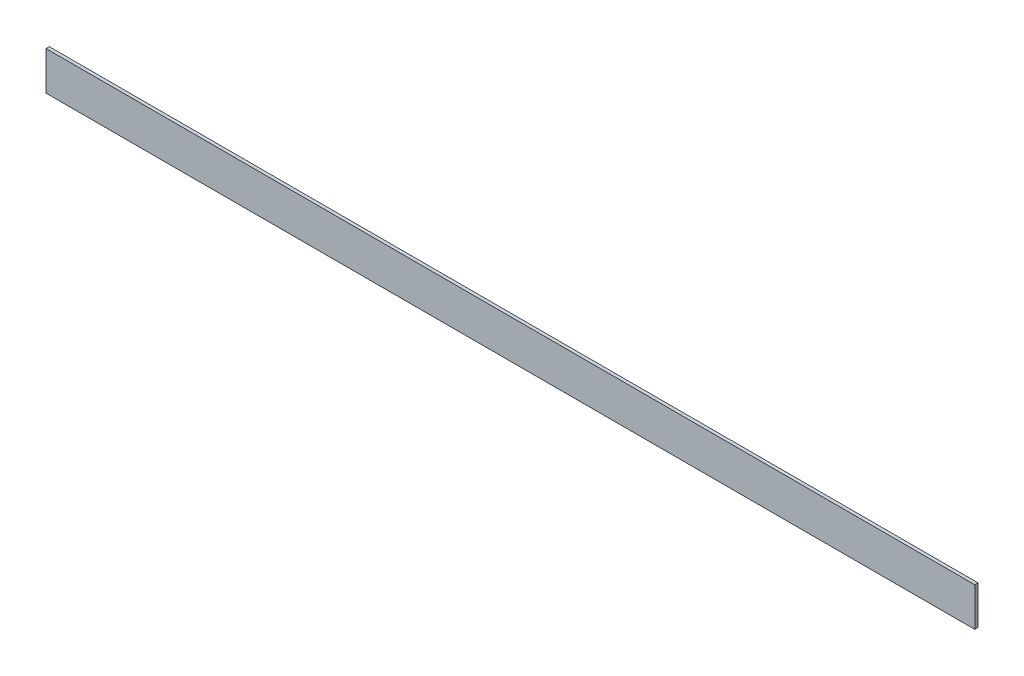
ISO-10303-21;
HEADER;
FILE_DESCRIPTION(('STEP AP214'),'2;1');
FILE_NAME('part.step','',(''),(''),'','','');
FILE_SCHEMA(('AUTOMOTIVE_DESIGN { 1 0 10303 214 1 1 1 1 }'));
ENDSEC;
DATA;
#1=APPLICATION_CONTEXT('core data for automotive mechanical design processes');
#2=APPLICATION_PROTOCOL_DEFINITION('international standard','automotive_design',2000,#1);
#3=PRODUCT_CONTEXT('',#1,'mechanical');
#4=PRODUCT('Part','Part','',(#3));
#5=PRODUCT_RELATED_PRODUCT_CATEGORY('part','',(#4));
#6=PRODUCT_DEFINITION_FORMATION('','',#4);
#7=PRODUCT_DEFINITION_CONTEXT('part definition',#1,'design');
#8=PRODUCT_DEFINITION('design','',#6,#7);
#9=PRODUCT_DEFINITION_SHAPE('','',#8);
#10=(LENGTH_UNIT() NAMED_UNIT(*) SI_UNIT(.MILLI.,.METRE.));
#11=(NAMED_UNIT(*) PLANE_ANGLE_UNIT() SI_UNIT($,.RADIAN.));
#12=(NAMED_UNIT(*) SI_UNIT($,.STERADIAN.) SOLID_ANGLE_UNIT());
#13=UNCERTAINTY_MEASURE_WITH_UNIT(LENGTH_MEASURE(1.E-05),#10,'distance_accuracy_value','');
#14=(GEOMETRIC_REPRESENTATION_CONTEXT(3) GLOBAL_UNCERTAINTY_ASSIGNED_CONTEXT((#13)) GLOBAL_UNIT_ASSIGNED_CONTEXT((#10,
#11,#12)) REPRESENTATION_CONTEXT('',''));
#15=CARTESIAN_POINT('',(0.,0.,0.));
#16=DIRECTION('',(0.,0.,1.));
#17=DIRECTION('',(1.,0.,0.));
#18=AXIS2_PLACEMENT_3D('',#15,#16,#17);
#19=CARTESIAN_POINT('',(1828.8,-38.1,-3.175));
#20=DIRECTION('',(0.,0.,1.));
#21=DIRECTION('',(1.,0.,0.));
#22=AXIS2_PLACEMENT_3D('',#19,#20,#21);
#23=PLANE('',#22);
#24=DIRECTION('',(0.,1.,0.));
#25=VECTOR('',#24,1.);
#26=CARTESIAN_POINT('',(0.,-38.1,-3.175));
#27=LINE('',#26,#25);
#28=CARTESIAN_POINT('',(0.,-38.1,-3.175));
#29=VERTEX_POINT('',#28);
#30=CARTESIAN_POINT('',(0.,38.1,-3.175));
#31=VERTEX_POINT('',#30);
#32=EDGE_CURVE('E98',#29,#31,#27,.T.);
#33=ORIENTED_EDGE('',*,*,#32,.T.);
#34=DIRECTION('',(-1.,0.,0.));
#35=VECTOR('',#34,1.);
#36=CARTESIAN_POINT('',(1828.8,38.1,-3.175));
#37=LINE('',#36,#35);
#38=CARTESIAN_POINT('',(1828.8,38.1,-3.175));
#39=VERTEX_POINT('',#38);
#40=EDGE_CURVE('E11',#39,#31,#37,.T.);
#41=ORIENTED_EDGE('',*,*,#40,.F.);
#42=DIRECTION('',(0.,1.,0.));
#43=VECTOR('',#42,1.);
#44=CARTESIAN_POINT('',(1828.8,-38.1,-3.175));
#45=LINE('',#44,#43);
#46=CARTESIAN_POINT('',(1828.8,-38.1,-3.175));
#47=VERTEX_POINT('',#46);
#48=EDGE_CURVE('E86',#47,#39,#45,.T.);
#49=ORIENTED_EDGE('',*,*,#48,.F.);
#50=DIRECTION('',(-1.,0.,0.));
#51=VECTOR('',#50,1.);
#52=CARTESIAN_POINT('',(1828.8,-38.1,-3.175));
#53=LINE('',#52,#51);
#54=EDGE_CURVE('E94',#47,#29,#53,.T.);
#55=ORIENTED_EDGE('',*,*,#54,.T.);
#56=EDGE_LOOP('',(#33,#41,#49,#55));
#57=FACE_BOUND('',#56,.T.);
#58=ADVANCED_FACE('F35',(#57),#23,.F.);
#59=CARTESIAN_POINT('',(1828.8,38.1,3.175));
#60=DIRECTION('',(0.,-1.,0.));
#61=DIRECTION('',(0.,0.,-1.));
#62=AXIS2_PLACEMENT_3D('',#59,#60,#61);
#63=PLANE('',#62);
#64=DIRECTION('',(0.,0.,1.));
#65=VECTOR('',#64,1.);
#66=CARTESIAN_POINT('',(0.,38.1,3.175));
#67=LINE('',#66,#65);
#68=CARTESIAN_POINT('',(0.,38.1,3.175));
#69=VERTEX_POINT('',#68);
#70=EDGE_CURVE('E90',#31,#69,#67,.T.);
#71=ORIENTED_EDGE('',*,*,#70,.T.);
#72=DIRECTION('',(-1.,0.,0.));
#73=VECTOR('',#72,1.);
#74=CARTESIAN_POINT('',(1828.8,38.1,3.175));
#75=LINE('',#74,#73);
#76=CARTESIAN_POINT('',(1828.8,38.1,3.175));
#77=VERTEX_POINT('',#76);
#78=EDGE_CURVE('E43',#77,#69,#75,.T.);
#79=ORIENTED_EDGE('',*,*,#78,.F.);
#80=DIRECTION('',(0.,0.,1.));
#81=VECTOR('',#80,1.);
#82=CARTESIAN_POINT('',(1828.8,38.1,3.175));
#83=LINE('',#82,#81);
#84=EDGE_CURVE('E81',#39,#77,#83,.T.);
#85=ORIENTED_EDGE('',*,*,#84,.F.);
#86=ORIENTED_EDGE('',*,*,#40,.T.);
#87=EDGE_LOOP('',(#71,#79,#85,#86));
#88=FACE_BOUND('',#87,.T.);
#89=ADVANCED_FACE('F89',(#88),#63,.F.);
#90=CARTESIAN_POINT('',(1828.8,-38.1,3.175));
#91=DIRECTION('',(0.,0.,-1.));
#92=DIRECTION('',(-1.,0.,0.));
#93=AXIS2_PLACEMENT_3D('',#90,#91,#92);
#94=PLANE('',#93);
#95=DIRECTION('',(0.,-1.,0.));
#96=VECTOR('',#95,1.);
#97=CARTESIAN_POINT('',(0.,-38.1,3.175));
#98=LINE('',#97,#96);
#99=CARTESIAN_POINT('',(0.,-38.1,3.175));
#100=VERTEX_POINT('',#99);
#101=EDGE_CURVE('E68',#69,#100,#98,.T.);
#102=ORIENTED_EDGE('',*,*,#101,.T.);
#103=DIRECTION('',(-1.,0.,0.));
#104=VECTOR('',#103,1.);
#105=CARTESIAN_POINT('',(1828.8,-38.1,3.175));
#106=LINE('',#105,#104);
#107=CARTESIAN_POINT('',(1828.8,-38.1,3.175));
#108=VERTEX_POINT('',#107);
#109=EDGE_CURVE('E91',#108,#100,#106,.T.);
#110=ORIENTED_EDGE('',*,*,#109,.F.);
#111=DIRECTION('',(0.,-1.,0.));
#112=VECTOR('',#111,1.);
#113=CARTESIAN_POINT('',(1828.8,-38.1,3.175));
#114=LINE('',#113,#112);
#115=EDGE_CURVE('E84',#77,#108,#114,.T.);
#116=ORIENTED_EDGE('',*,*,#115,.F.);
#117=ORIENTED_EDGE('',*,*,#78,.T.);
#118=EDGE_LOOP('',(#102,#110,#116,#117));
#119=FACE_BOUND('',#118,.T.);
#120=ADVANCED_FACE('F92',(#119),#94,.F.);
#121=CARTESIAN_POINT('',(1828.8,-38.1,3.175));
#122=DIRECTION('',(0.,1.,0.));
#123=DIRECTION('',(0.,0.,1.));
#124=AXIS2_PLACEMENT_3D('',#121,#122,#123);
#125=PLANE('',#124);
#126=DIRECTION('',(0.,0.,-1.));
#127=VECTOR('',#126,1.);
#128=CARTESIAN_POINT('',(0.,-38.1,3.175));
#129=LINE('',#128,#127);
#130=EDGE_CURVE('E74',#100,#29,#129,.T.);
#131=ORIENTED_EDGE('',*,*,#130,.T.);
#132=ORIENTED_EDGE('',*,*,#54,.F.);
#133=DIRECTION('',(0.,0.,-1.));
#134=VECTOR('',#133,1.);
#135=CARTESIAN_POINT('',(1828.8,-38.1,3.175));
#136=LINE('',#135,#134);
#137=EDGE_CURVE('E51',#108,#47,#136,.T.);
#138=ORIENTED_EDGE('',*,*,#137,.F.);
#139=ORIENTED_EDGE('',*,*,#109,.T.);
#140=EDGE_LOOP('',(#131,#132,#138,#139));
#141=FACE_BOUND('',#140,.T.);
#142=ADVANCED_FACE('F105',(#141),#125,.F.);
#143=CARTESIAN_POINT('',(1828.8,0.,0.));
#144=DIRECTION('',(-1.,0.,0.));
#145=DIRECTION('',(0.,0.,1.));
#146=AXIS2_PLACEMENT_3D('',#143,#144,#145);
#147=PLANE('',#146);
#148=ORIENTED_EDGE('',*,*,#48,.T.);
#149=ORIENTED_EDGE('',*,*,#84,.T.);
#150=ORIENTED_EDGE('',*,*,#115,.T.);
#151=ORIENTED_EDGE('',*,*,#137,.T.);
#152=EDGE_LOOP('',(#148,#149,#150,#151));
#153=FACE_BOUND('',#152,.T.);
#154=ADVANCED_FACE('F82',(#153),#147,.F.);
#155=CARTESIAN_POINT('',(0.,0.,0.));
#156=DIRECTION('',(-1.,0.,0.));
#157=DIRECTION('',(0.,0.,1.));
#158=AXIS2_PLACEMENT_3D('',#155,#156,#157);
#159=PLANE('',#158);
#160=ORIENTED_EDGE('',*,*,#32,.F.);
#161=ORIENTED_EDGE('',*,*,#130,.F.);
#162=ORIENTED_EDGE('',*,*,#101,.F.);
#163=ORIENTED_EDGE('',*,*,#70,.F.);
#164=EDGE_LOOP('',(#160,#161,#162,#163));
#165=FACE_BOUND('',#164,.T.);
#166=ADVANCED_FACE('F108',(#165),#159,.T.);
#167=CLOSED_SHELL('',(#58,#89,#120,#142,#154,#166));
#168=MANIFOLD_SOLID_BREP('B2',#167);
#169=ADVANCED_BREP_SHAPE_REPRESENTATION('',(#18,#168),#14);
#170=SHAPE_DEFINITION_REPRESENTATION(#9,#169);
ENDSEC;
END-ISO-10303-21;
